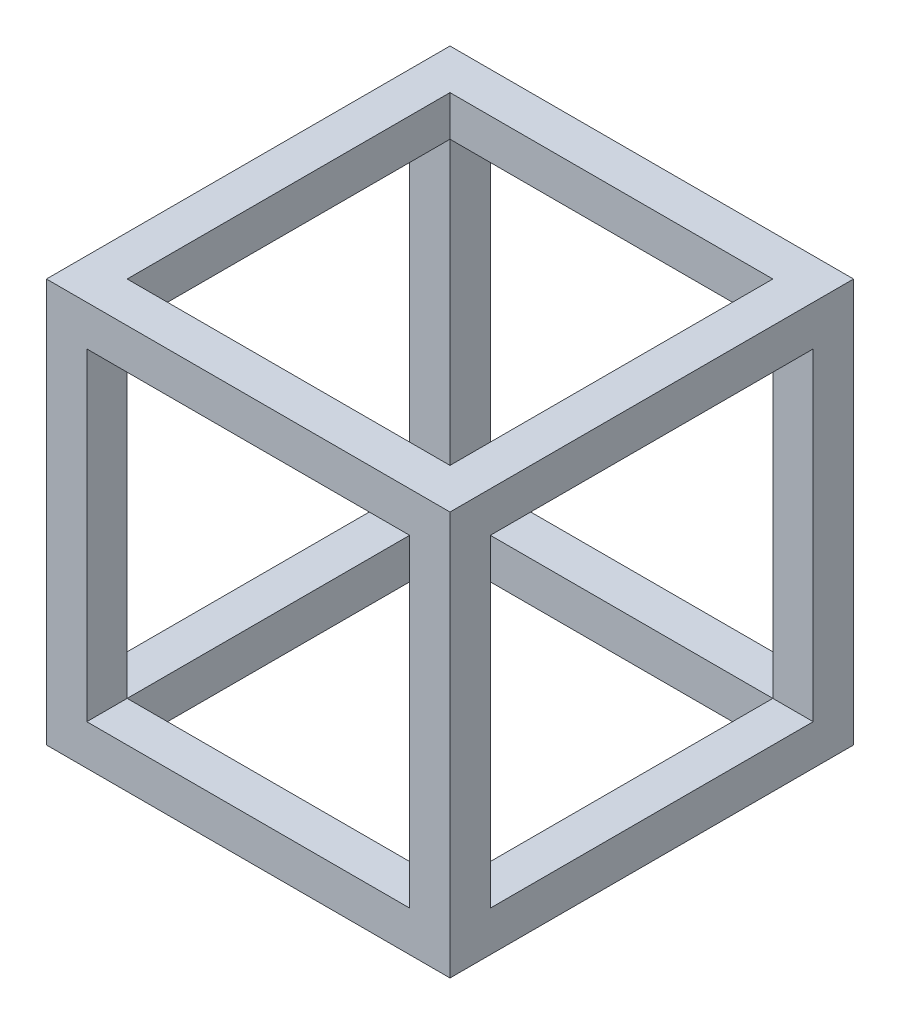
ISO-10303-21;
HEADER;
FILE_DESCRIPTION(('STEP AP214'),'2;1');
FILE_NAME('part.step','',(''),(''),'','','');
FILE_SCHEMA(('AUTOMOTIVE_DESIGN { 1 0 10303 214 1 1 1 1 }'));
ENDSEC;
DATA;
#1=APPLICATION_CONTEXT('core data for automotive mechanical design processes');
#2=APPLICATION_PROTOCOL_DEFINITION('international standard','automotive_design',2000,#1);
#3=PRODUCT_CONTEXT('',#1,'mechanical');
#4=PRODUCT('Part','Part','',(#3));
#5=PRODUCT_RELATED_PRODUCT_CATEGORY('part','',(#4));
#6=PRODUCT_DEFINITION_FORMATION('','',#4);
#7=PRODUCT_DEFINITION_CONTEXT('part definition',#1,'design');
#8=PRODUCT_DEFINITION('design','',#6,#7);
#9=PRODUCT_DEFINITION_SHAPE('','',#8);
#10=(LENGTH_UNIT() NAMED_UNIT(*) SI_UNIT(.MILLI.,.METRE.));
#11=(NAMED_UNIT(*) PLANE_ANGLE_UNIT() SI_UNIT($,.RADIAN.));
#12=(NAMED_UNIT(*) SI_UNIT($,.STERADIAN.) SOLID_ANGLE_UNIT());
#13=UNCERTAINTY_MEASURE_WITH_UNIT(LENGTH_MEASURE(1.E-05),#10,'distance_accuracy_value','');
#14=(GEOMETRIC_REPRESENTATION_CONTEXT(3) GLOBAL_UNCERTAINTY_ASSIGNED_CONTEXT((#13)) GLOBAL_UNIT_ASSIGNED_CONTEXT((#10,
#11,#12)) REPRESENTATION_CONTEXT('',''));
#15=CARTESIAN_POINT('',(0.,0.,0.));
#16=DIRECTION('',(0.,0.,1.));
#17=DIRECTION('',(1.,0.,0.));
#18=AXIS2_PLACEMENT_3D('',#15,#16,#17);
#19=CARTESIAN_POINT('',(10.,90.,0.));
#20=DIRECTION('',(0.,1.,0.));
#21=DIRECTION('',(0.,0.,1.));
#22=AXIS2_PLACEMENT_3D('',#19,#20,#21);
#23=PLANE('',#22);
#24=DIRECTION('',(1.,0.,0.));
#25=VECTOR('',#24,1.);
#26=CARTESIAN_POINT('',(0.,90.,10.));
#27=LINE('',#26,#25);
#28=CARTESIAN_POINT('',(0.,90.,10.));
#29=VERTEX_POINT('',#28);
#30=CARTESIAN_POINT('',(10.,90.,10.));
#31=VERTEX_POINT('',#30);
#32=EDGE_CURVE('E276',#29,#31,#27,.T.);
#33=ORIENTED_EDGE('',*,*,#32,.T.);
#34=DIRECTION('',(0.,0.,1.));
#35=VECTOR('',#34,1.);
#36=CARTESIAN_POINT('',(10.,90.,0.));
#37=LINE('',#36,#35);
#38=CARTESIAN_POINT('',(10.,90.,90.));
#39=VERTEX_POINT('',#38);
#40=EDGE_CURVE('E224',#31,#39,#37,.T.);
#41=ORIENTED_EDGE('',*,*,#40,.T.);
#42=DIRECTION('',(1.,0.,0.));
#43=VECTOR('',#42,1.);
#44=CARTESIAN_POINT('',(0.,90.,90.));
#45=LINE('',#44,#43);
#46=CARTESIAN_POINT('',(0.,90.,90.));
#47=VERTEX_POINT('',#46);
#48=EDGE_CURVE('E272',#47,#39,#45,.T.);
#49=ORIENTED_EDGE('',*,*,#48,.F.);
#50=DIRECTION('',(0.,0.,1.));
#51=VECTOR('',#50,1.);
#52=CARTESIAN_POINT('',(0.,90.,90.));
#53=LINE('',#52,#51);
#54=EDGE_CURVE('E243',#29,#47,#53,.T.);
#55=ORIENTED_EDGE('',*,*,#54,.F.);
#56=EDGE_LOOP('',(#33,#41,#49,#55));
#57=FACE_BOUND('',#56,.T.);
#58=ADVANCED_FACE('F38',(#57),#23,.F.);
#59=DIRECTION('',(0.,0.,1.));
#60=VECTOR('',#59,1.);
#61=CARTESIAN_POINT('',(90.,90.,0.));
#62=LINE('',#61,#60);
#63=CARTESIAN_POINT('',(90.,90.,0.));
#64=VERTEX_POINT('',#63);
#65=CARTESIAN_POINT('',(90.,90.,10.));
#66=VERTEX_POINT('',#65);
#67=EDGE_CURVE('E320',#64,#66,#62,.T.);
#68=ORIENTED_EDGE('',*,*,#67,.T.);
#69=DIRECTION('',(-1.,0.,0.));
#70=VECTOR('',#69,1.);
#71=CARTESIAN_POINT('',(10.,90.,10.));
#72=LINE('',#71,#70);
#73=EDGE_CURVE('E236',#66,#31,#72,.T.);
#74=ORIENTED_EDGE('',*,*,#73,.T.);
#75=DIRECTION('',(0.,0.,1.));
#76=VECTOR('',#75,1.);
#77=CARTESIAN_POINT('',(10.,90.,0.));
#78=LINE('',#77,#76);
#79=CARTESIAN_POINT('',(10.,90.,0.));
#80=VERTEX_POINT('',#79);
#81=EDGE_CURVE('E315',#80,#31,#78,.T.);
#82=ORIENTED_EDGE('',*,*,#81,.F.);
#83=DIRECTION('',(-1.,0.,0.));
#84=VECTOR('',#83,1.);
#85=CARTESIAN_POINT('',(10.,90.,0.));
#86=LINE('',#85,#84);
#87=EDGE_CURVE('E301',#64,#80,#86,.T.);
#88=ORIENTED_EDGE('',*,*,#87,.F.);
#89=EDGE_LOOP('',(#68,#74,#82,#88));
#90=FACE_BOUND('',#89,.T.);
#91=ADVANCED_FACE('F410',(#90),#23,.F.);
#92=CARTESIAN_POINT('',(90.,90.,90.));
#93=VERTEX_POINT('',#92);
#94=CARTESIAN_POINT('',(100.,90.,90.));
#95=VERTEX_POINT('',#94);
#96=EDGE_CURVE('E275',#93,#95,#45,.T.);
#97=ORIENTED_EDGE('',*,*,#96,.F.);
#98=DIRECTION('',(0.,0.,-1.));
#99=VECTOR('',#98,1.);
#100=CARTESIAN_POINT('',(90.,90.,0.));
#101=LINE('',#100,#99);
#102=EDGE_CURVE('E230',#93,#66,#101,.T.);
#103=ORIENTED_EDGE('',*,*,#102,.T.);
#104=CARTESIAN_POINT('',(100.,90.,10.));
#105=VERTEX_POINT('',#104);
#106=EDGE_CURVE('E253',#66,#105,#27,.T.);
#107=ORIENTED_EDGE('',*,*,#106,.T.);
#108=DIRECTION('',(0.,0.,1.));
#109=VECTOR('',#108,1.);
#110=CARTESIAN_POINT('',(100.,90.,90.));
#111=LINE('',#110,#109);
#112=EDGE_CURVE('E255',#105,#95,#111,.T.);
#113=ORIENTED_EDGE('',*,*,#112,.T.);
#114=EDGE_LOOP('',(#97,#103,#107,#113));
#115=FACE_BOUND('',#114,.T.);
#116=ADVANCED_FACE('F442',(#115),#23,.F.);
#117=CARTESIAN_POINT('',(10.,10.,0.));
#118=DIRECTION('',(0.,-1.,0.));
#119=DIRECTION('',(0.,0.,-1.));
#120=AXIS2_PLACEMENT_3D('',#117,#118,#119);
#121=PLANE('',#120);
#122=DIRECTION('',(1.,0.,0.));
#123=VECTOR('',#122,1.);
#124=CARTESIAN_POINT('',(0.,10.,90.));
#125=LINE('',#124,#123);
#126=CARTESIAN_POINT('',(0.,10.,90.));
#127=VERTEX_POINT('',#126);
#128=CARTESIAN_POINT('',(10.,10.,90.));
#129=VERTEX_POINT('',#128);
#130=EDGE_CURVE('E268',#127,#129,#125,.T.);
#131=ORIENTED_EDGE('',*,*,#130,.T.);
#132=DIRECTION('',(0.,0.,-1.));
#133=VECTOR('',#132,1.);
#134=CARTESIAN_POINT('',(10.,10.,0.));
#135=LINE('',#134,#133);
#136=CARTESIAN_POINT('',(10.,10.,10.));
#137=VERTEX_POINT('',#136);
#138=EDGE_CURVE('E185',#129,#137,#135,.T.);
#139=ORIENTED_EDGE('',*,*,#138,.T.);
#140=DIRECTION('',(1.,0.,0.));
#141=VECTOR('',#140,1.);
#142=CARTESIAN_POINT('',(0.,10.,10.));
#143=LINE('',#142,#141);
#144=CARTESIAN_POINT('',(0.,10.,10.));
#145=VERTEX_POINT('',#144);
#146=EDGE_CURVE('E263',#145,#137,#143,.T.);
#147=ORIENTED_EDGE('',*,*,#146,.F.);
#148=DIRECTION('',(0.,0.,-1.));
#149=VECTOR('',#148,1.);
#150=CARTESIAN_POINT('',(0.,10.,90.));
#151=LINE('',#150,#149);
#152=EDGE_CURVE('E250',#127,#145,#151,.T.);
#153=ORIENTED_EDGE('',*,*,#152,.F.);
#154=EDGE_LOOP('',(#131,#139,#147,#153));
#155=FACE_BOUND('',#154,.T.);
#156=ADVANCED_FACE('F371',(#155),#121,.F.);
#157=DIRECTION('',(0.,0.,1.));
#158=VECTOR('',#157,1.);
#159=CARTESIAN_POINT('',(10.,10.,0.));
#160=LINE('',#159,#158);
#161=CARTESIAN_POINT('',(10.,10.,0.));
#162=VERTEX_POINT('',#161);
#163=EDGE_CURVE('E328',#162,#137,#160,.T.);
#164=ORIENTED_EDGE('',*,*,#163,.T.);
#165=DIRECTION('',(1.,0.,0.));
#166=VECTOR('',#165,1.);
#167=CARTESIAN_POINT('',(10.,10.,10.));
#168=LINE('',#167,#166);
#169=CARTESIAN_POINT('',(90.,10.,10.));
#170=VERTEX_POINT('',#169);
#171=EDGE_CURVE('E11',#137,#170,#168,.T.);
#172=ORIENTED_EDGE('',*,*,#171,.T.);
#173=DIRECTION('',(0.,0.,1.));
#174=VECTOR('',#173,1.);
#175=CARTESIAN_POINT('',(90.,10.,0.));
#176=LINE('',#175,#174);
#177=CARTESIAN_POINT('',(90.,10.,0.));
#178=VERTEX_POINT('',#177);
#179=EDGE_CURVE('E324',#178,#170,#176,.T.);
#180=ORIENTED_EDGE('',*,*,#179,.F.);
#181=DIRECTION('',(1.,0.,0.));
#182=VECTOR('',#181,1.);
#183=CARTESIAN_POINT('',(10.,10.,0.));
#184=LINE('',#183,#182);
#185=EDGE_CURVE('E294',#162,#178,#184,.T.);
#186=ORIENTED_EDGE('',*,*,#185,.F.);
#187=EDGE_LOOP('',(#164,#172,#180,#186));
#188=FACE_BOUND('',#187,.T.);
#189=ADVANCED_FACE('F400',(#188),#121,.F.);
#190=CARTESIAN_POINT('',(100.,10.,10.));
#191=VERTEX_POINT('',#190);
#192=EDGE_CURVE('E267',#170,#191,#143,.T.);
#193=ORIENTED_EDGE('',*,*,#192,.F.);
#194=DIRECTION('',(0.,0.,1.));
#195=VECTOR('',#194,1.);
#196=CARTESIAN_POINT('',(90.,10.,0.));
#197=LINE('',#196,#195);
#198=CARTESIAN_POINT('',(90.,10.,90.));
#199=VERTEX_POINT('',#198);
#200=EDGE_CURVE('E227',#170,#199,#197,.T.);
#201=ORIENTED_EDGE('',*,*,#200,.T.);
#202=CARTESIAN_POINT('',(100.,10.,90.));
#203=VERTEX_POINT('',#202);
#204=EDGE_CURVE('E271',#199,#203,#125,.T.);
#205=ORIENTED_EDGE('',*,*,#204,.T.);
#206=DIRECTION('',(0.,0.,-1.));
#207=VECTOR('',#206,1.);
#208=CARTESIAN_POINT('',(100.,10.,90.));
#209=LINE('',#208,#207);
#210=EDGE_CURVE('E244',#203,#191,#209,.T.);
#211=ORIENTED_EDGE('',*,*,#210,.T.);
#212=EDGE_LOOP('',(#193,#201,#205,#211));
#213=FACE_BOUND('',#212,.T.);
#214=ADVANCED_FACE('F392',(#213),#121,.F.);
#215=CARTESIAN_POINT('',(10.,10.,0.));
#216=DIRECTION('',(-1.,0.,0.));
#217=DIRECTION('',(0.,0.,1.));
#218=AXIS2_PLACEMENT_3D('',#215,#216,#217);
#219=PLANE('',#218);
#220=ORIENTED_EDGE('',*,*,#81,.T.);
#221=DIRECTION('',(0.,-1.,0.));
#222=VECTOR('',#221,1.);
#223=CARTESIAN_POINT('',(10.,10.,10.));
#224=LINE('',#223,#222);
#225=EDGE_CURVE('E287',#31,#137,#224,.T.);
#226=ORIENTED_EDGE('',*,*,#225,.T.);
#227=ORIENTED_EDGE('',*,*,#163,.F.);
#228=DIRECTION('',(0.,-1.,0.));
#229=VECTOR('',#228,1.);
#230=CARTESIAN_POINT('',(10.,10.,0.));
#231=LINE('',#230,#229);
#232=EDGE_CURVE('E291',#80,#162,#231,.T.);
#233=ORIENTED_EDGE('',*,*,#232,.F.);
#234=EDGE_LOOP('',(#220,#226,#227,#233));
#235=FACE_BOUND('',#234,.T.);
#236=ADVANCED_FACE('F416',(#235),#219,.F.);
#237=CARTESIAN_POINT('',(90.,10.,0.));
#238=DIRECTION('',(1.,0.,0.));
#239=DIRECTION('',(0.,0.,-1.));
#240=AXIS2_PLACEMENT_3D('',#237,#238,#239);
#241=PLANE('',#240);
#242=ORIENTED_EDGE('',*,*,#179,.T.);
#243=DIRECTION('',(0.,1.,0.));
#244=VECTOR('',#243,1.);
#245=CARTESIAN_POINT('',(90.,10.,10.));
#246=LINE('',#245,#244);
#247=EDGE_CURVE('E284',#170,#66,#246,.T.);
#248=ORIENTED_EDGE('',*,*,#247,.T.);
#249=ORIENTED_EDGE('',*,*,#67,.F.);
#250=DIRECTION('',(0.,1.,0.));
#251=VECTOR('',#250,1.);
#252=CARTESIAN_POINT('',(90.,10.,0.));
#253=LINE('',#252,#251);
#254=EDGE_CURVE('E298',#178,#64,#253,.T.);
#255=ORIENTED_EDGE('',*,*,#254,.F.);
#256=EDGE_LOOP('',(#242,#248,#249,#255));
#257=FACE_BOUND('',#256,.T.);
#258=ADVANCED_FACE('F407',(#257),#241,.F.);
#259=CARTESIAN_POINT('',(0.,0.,100.));
#260=DIRECTION('',(1.,0.,0.));
#261=DIRECTION('',(0.,0.,-1.));
#262=AXIS2_PLACEMENT_3D('',#259,#260,#261);
#263=PLANE('',#262);
#264=ORIENTED_EDGE('',*,*,#152,.T.);
#265=DIRECTION('',(0.,1.,0.));
#266=VECTOR('',#265,1.);
#267=CARTESIAN_POINT('',(0.,10.,10.));
#268=LINE('',#267,#266);
#269=EDGE_CURVE('E240',#145,#29,#268,.T.);
#270=ORIENTED_EDGE('',*,*,#269,.T.);
#271=ORIENTED_EDGE('',*,*,#54,.T.);
#272=DIRECTION('',(0.,-1.,0.));
#273=VECTOR('',#272,1.);
#274=CARTESIAN_POINT('',(0.,10.,90.));
#275=LINE('',#274,#273);
#276=EDGE_CURVE('E247',#47,#127,#275,.T.);
#277=ORIENTED_EDGE('',*,*,#276,.T.);
#278=EDGE_LOOP('',(#264,#270,#271,#277));
#279=FACE_BOUND('',#278,.T.);
#280=DIRECTION('',(0.,-1.,0.));
#281=VECTOR('',#280,1.);
#282=CARTESIAN_POINT('',(0.,0.,0.));
#283=LINE('',#282,#281);
#284=CARTESIAN_POINT('',(0.,100.,0.));
#285=VERTEX_POINT('',#284);
#286=CARTESIAN_POINT('',(0.,0.,0.));
#287=VERTEX_POINT('',#286);
#288=EDGE_CURVE('E318',#285,#287,#283,.T.);
#289=ORIENTED_EDGE('',*,*,#288,.T.);
#290=DIRECTION('',(0.,0.,-1.));
#291=VECTOR('',#290,1.);
#292=CARTESIAN_POINT('',(0.,0.,100.));
#293=LINE('',#292,#291);
#294=CARTESIAN_POINT('',(0.,0.,100.));
#295=VERTEX_POINT('',#294);
#296=EDGE_CURVE('E357',#295,#287,#293,.T.);
#297=ORIENTED_EDGE('',*,*,#296,.F.);
#298=DIRECTION('',(0.,-1.,0.));
#299=VECTOR('',#298,1.);
#300=CARTESIAN_POINT('',(0.,0.,100.));
#301=LINE('',#300,#299);
#302=CARTESIAN_POINT('',(0.,100.,100.));
#303=VERTEX_POINT('',#302);
#304=EDGE_CURVE('E331',#303,#295,#301,.T.);
#305=ORIENTED_EDGE('',*,*,#304,.F.);
#306=DIRECTION('',(0.,0.,-1.));
#307=VECTOR('',#306,1.);
#308=CARTESIAN_POINT('',(0.,100.,100.));
#309=LINE('',#308,#307);
#310=EDGE_CURVE('E341',#303,#285,#309,.T.);
#311=ORIENTED_EDGE('',*,*,#310,.T.);
#312=EDGE_LOOP('',(#289,#297,#305,#311));
#313=FACE_BOUND('',#312,.T.);
#314=ADVANCED_FACE('F40',(#279,#313),#263,.F.);
#315=CARTESIAN_POINT('',(0.,0.,100.));
#316=DIRECTION('',(0.,1.,0.));
#317=DIRECTION('',(0.,0.,1.));
#318=AXIS2_PLACEMENT_3D('',#315,#316,#317);
#319=PLANE('',#318);
#320=DIRECTION('',(-1.,0.,0.));
#321=VECTOR('',#320,1.);
#322=CARTESIAN_POINT('',(90.,0.,10.));
#323=LINE('',#322,#321);
#324=CARTESIAN_POINT('',(90.,0.,10.));
#325=VERTEX_POINT('',#324);
#326=CARTESIAN_POINT('',(10.,0.,10.));
#327=VERTEX_POINT('',#326);
#328=EDGE_CURVE('E200',#325,#327,#323,.T.);
#329=ORIENTED_EDGE('',*,*,#328,.T.);
#330=DIRECTION('',(0.,0.,1.));
#331=VECTOR('',#330,1.);
#332=CARTESIAN_POINT('',(10.,0.,10.));
#333=LINE('',#332,#331);
#334=CARTESIAN_POINT('',(10.,0.,90.));
#335=VERTEX_POINT('',#334);
#336=EDGE_CURVE('E182',#327,#335,#333,.T.);
#337=ORIENTED_EDGE('',*,*,#336,.T.);
#338=DIRECTION('',(1.,0.,0.));
#339=VECTOR('',#338,1.);
#340=CARTESIAN_POINT('',(10.,0.,90.));
#341=LINE('',#340,#339);
#342=CARTESIAN_POINT('',(90.,0.,90.));
#343=VERTEX_POINT('',#342);
#344=EDGE_CURVE('E192',#335,#343,#341,.T.);
#345=ORIENTED_EDGE('',*,*,#344,.T.);
#346=DIRECTION('',(0.,0.,-1.));
#347=VECTOR('',#346,1.);
#348=CARTESIAN_POINT('',(90.,0.,90.));
#349=LINE('',#348,#347);
#350=EDGE_CURVE('E53',#343,#325,#349,.T.);
#351=ORIENTED_EDGE('',*,*,#350,.T.);
#352=EDGE_LOOP('',(#329,#337,#345,#351));
#353=FACE_BOUND('',#352,.T.);
#354=DIRECTION('',(1.,0.,0.));
#355=VECTOR('',#354,1.);
#356=CARTESIAN_POINT('',(0.,0.,0.));
#357=LINE('',#356,#355);
#358=CARTESIAN_POINT('',(100.,0.,0.));
#359=VERTEX_POINT('',#358);
#360=EDGE_CURVE('E344',#287,#359,#357,.T.);
#361=ORIENTED_EDGE('',*,*,#360,.T.);
#362=DIRECTION('',(0.,0.,-1.));
#363=VECTOR('',#362,1.);
#364=CARTESIAN_POINT('',(100.,0.,100.));
#365=LINE('',#364,#363);
#366=CARTESIAN_POINT('',(100.,0.,100.));
#367=VERTEX_POINT('',#366);
#368=EDGE_CURVE('E354',#367,#359,#365,.T.);
#369=ORIENTED_EDGE('',*,*,#368,.F.);
#370=DIRECTION('',(1.,0.,0.));
#371=VECTOR('',#370,1.);
#372=CARTESIAN_POINT('',(0.,0.,100.));
#373=LINE('',#372,#371);
#374=EDGE_CURVE('E334',#295,#367,#373,.T.);
#375=ORIENTED_EDGE('',*,*,#374,.F.);
#376=ORIENTED_EDGE('',*,*,#296,.T.);
#377=EDGE_LOOP('',(#361,#369,#375,#376));
#378=FACE_BOUND('',#377,.T.);
#379=ADVANCED_FACE('F197',(#353,#378),#319,.F.);
#380=CARTESIAN_POINT('',(100.,0.,100.));
#381=DIRECTION('',(-1.,0.,0.));
#382=DIRECTION('',(0.,0.,1.));
#383=AXIS2_PLACEMENT_3D('',#380,#381,#382);
#384=PLANE('',#383);
#385=ORIENTED_EDGE('',*,*,#112,.F.);
#386=DIRECTION('',(0.,1.,0.));
#387=VECTOR('',#386,1.);
#388=CARTESIAN_POINT('',(100.,10.,10.));
#389=LINE('',#388,#387);
#390=EDGE_CURVE('E239',#191,#105,#389,.T.);
#391=ORIENTED_EDGE('',*,*,#390,.F.);
#392=ORIENTED_EDGE('',*,*,#210,.F.);
#393=DIRECTION('',(0.,-1.,0.));
#394=VECTOR('',#393,1.);
#395=CARTESIAN_POINT('',(100.,10.,90.));
#396=LINE('',#395,#394);
#397=EDGE_CURVE('E258',#95,#203,#396,.T.);
#398=ORIENTED_EDGE('',*,*,#397,.F.);
#399=EDGE_LOOP('',(#385,#391,#392,#398));
#400=FACE_BOUND('',#399,.T.);
#401=DIRECTION('',(0.,1.,0.));
#402=VECTOR('',#401,1.);
#403=CARTESIAN_POINT('',(100.,0.,0.));
#404=LINE('',#403,#402);
#405=CARTESIAN_POINT('',(100.,100.,0.));
#406=VERTEX_POINT('',#405);
#407=EDGE_CURVE('E346',#359,#406,#404,.T.);
#408=ORIENTED_EDGE('',*,*,#407,.T.);
#409=DIRECTION('',(0.,0.,-1.));
#410=VECTOR('',#409,1.);
#411=CARTESIAN_POINT('',(100.,100.,100.));
#412=LINE('',#411,#410);
#413=CARTESIAN_POINT('',(100.,100.,100.));
#414=VERTEX_POINT('',#413);
#415=EDGE_CURVE('E351',#414,#406,#412,.T.);
#416=ORIENTED_EDGE('',*,*,#415,.F.);
#417=DIRECTION('',(0.,1.,0.));
#418=VECTOR('',#417,1.);
#419=CARTESIAN_POINT('',(100.,0.,100.));
#420=LINE('',#419,#418);
#421=EDGE_CURVE('E337',#367,#414,#420,.T.);
#422=ORIENTED_EDGE('',*,*,#421,.F.);
#423=ORIENTED_EDGE('',*,*,#368,.T.);
#424=EDGE_LOOP('',(#408,#416,#422,#423));
#425=FACE_BOUND('',#424,.T.);
#426=ADVANCED_FACE('F445',(#400,#425),#384,.F.);
#427=CARTESIAN_POINT('',(0.,100.,100.));
#428=DIRECTION('',(0.,-1.,0.));
#429=DIRECTION('',(0.,0.,-1.));
#430=AXIS2_PLACEMENT_3D('',#427,#428,#429);
#431=PLANE('',#430);
#432=DIRECTION('',(1.,0.,0.));
#433=VECTOR('',#432,1.);
#434=CARTESIAN_POINT('',(10.,100.,90.));
#435=LINE('',#434,#433);
#436=CARTESIAN_POINT('',(10.,100.,90.));
#437=VERTEX_POINT('',#436);
#438=CARTESIAN_POINT('',(90.,100.,90.));
#439=VERTEX_POINT('',#438);
#440=EDGE_CURVE('E210',#437,#439,#435,.T.);
#441=ORIENTED_EDGE('',*,*,#440,.F.);
#442=DIRECTION('',(0.,0.,1.));
#443=VECTOR('',#442,1.);
#444=CARTESIAN_POINT('',(10.,100.,10.));
#445=LINE('',#444,#443);
#446=CARTESIAN_POINT('',(10.,100.,10.));
#447=VERTEX_POINT('',#446);
#448=EDGE_CURVE('E61',#447,#437,#445,.T.);
#449=ORIENTED_EDGE('',*,*,#448,.F.);
#450=DIRECTION('',(-1.,0.,0.));
#451=VECTOR('',#450,1.);
#452=CARTESIAN_POINT('',(90.,100.,10.));
#453=LINE('',#452,#451);
#454=CARTESIAN_POINT('',(90.,100.,10.));
#455=VERTEX_POINT('',#454);
#456=EDGE_CURVE('E201',#455,#447,#453,.T.);
#457=ORIENTED_EDGE('',*,*,#456,.F.);
#458=DIRECTION('',(0.,0.,-1.));
#459=VECTOR('',#458,1.);
#460=CARTESIAN_POINT('',(90.,100.,90.));
#461=LINE('',#460,#459);
#462=EDGE_CURVE('E204',#439,#455,#461,.T.);
#463=ORIENTED_EDGE('',*,*,#462,.F.);
#464=EDGE_LOOP('',(#441,#449,#457,#463));
#465=FACE_BOUND('',#464,.T.);
#466=DIRECTION('',(-1.,0.,0.));
#467=VECTOR('',#466,1.);
#468=CARTESIAN_POINT('',(0.,100.,0.));
#469=LINE('',#468,#467);
#470=EDGE_CURVE('E335',#406,#285,#469,.T.);
#471=ORIENTED_EDGE('',*,*,#470,.T.);
#472=ORIENTED_EDGE('',*,*,#310,.F.);
#473=DIRECTION('',(-1.,0.,0.));
#474=VECTOR('',#473,1.);
#475=CARTESIAN_POINT('',(0.,100.,100.));
#476=LINE('',#475,#474);
#477=EDGE_CURVE('E339',#414,#303,#476,.T.);
#478=ORIENTED_EDGE('',*,*,#477,.F.);
#479=ORIENTED_EDGE('',*,*,#415,.T.);
#480=EDGE_LOOP('',(#471,#472,#478,#479));
#481=FACE_BOUND('',#480,.T.);
#482=ADVANCED_FACE('F434',(#465,#481),#431,.F.);
#483=CARTESIAN_POINT('',(0.,0.,100.));
#484=DIRECTION('',(0.,0.,-1.));
#485=DIRECTION('',(-1.,0.,0.));
#486=AXIS2_PLACEMENT_3D('',#483,#484,#485);
#487=PLANE('',#486);
#488=DIRECTION('',(1.,0.,0.));
#489=VECTOR('',#488,1.);
#490=CARTESIAN_POINT('',(10.,10.,100.));
#491=LINE('',#490,#489);
#492=CARTESIAN_POINT('',(10.,10.,100.));
#493=VERTEX_POINT('',#492);
#494=CARTESIAN_POINT('',(90.,10.,100.));
#495=VERTEX_POINT('',#494);
#496=EDGE_CURVE('E307',#493,#495,#491,.T.);
#497=ORIENTED_EDGE('',*,*,#496,.F.);
#498=DIRECTION('',(0.,-1.,0.));
#499=VECTOR('',#498,1.);
#500=CARTESIAN_POINT('',(10.,10.,100.));
#501=LINE('',#500,#499);
#502=CARTESIAN_POINT('',(10.,90.,100.));
#503=VERTEX_POINT('',#502);
#504=EDGE_CURVE('E290',#503,#493,#501,.T.);
#505=ORIENTED_EDGE('',*,*,#504,.F.);
#506=DIRECTION('',(-1.,0.,0.));
#507=VECTOR('',#506,1.);
#508=CARTESIAN_POINT('',(10.,90.,100.));
#509=LINE('',#508,#507);
#510=CARTESIAN_POINT('',(90.,90.,100.));
#511=VERTEX_POINT('',#510);
#512=EDGE_CURVE('E295',#511,#503,#509,.T.);
#513=ORIENTED_EDGE('',*,*,#512,.F.);
#514=DIRECTION('',(0.,1.,0.));
#515=VECTOR('',#514,1.);
#516=CARTESIAN_POINT('',(90.,10.,100.));
#517=LINE('',#516,#515);
#518=EDGE_CURVE('E310',#495,#511,#517,.T.);
#519=ORIENTED_EDGE('',*,*,#518,.F.);
#520=EDGE_LOOP('',(#497,#505,#513,#519));
#521=FACE_BOUND('',#520,.T.);
#522=ORIENTED_EDGE('',*,*,#304,.T.);
#523=ORIENTED_EDGE('',*,*,#374,.T.);
#524=ORIENTED_EDGE('',*,*,#421,.T.);
#525=ORIENTED_EDGE('',*,*,#477,.T.);
#526=EDGE_LOOP('',(#522,#523,#524,#525));
#527=FACE_BOUND('',#526,.T.);
#528=ADVANCED_FACE('F378',(#521,#527),#487,.F.);
#529=CARTESIAN_POINT('',(0.,0.,0.));
#530=DIRECTION('',(0.,0.,-1.));
#531=DIRECTION('',(-1.,0.,0.));
#532=AXIS2_PLACEMENT_3D('',#529,#530,#531);
#533=PLANE('',#532);
#534=ORIENTED_EDGE('',*,*,#232,.T.);
#535=ORIENTED_EDGE('',*,*,#185,.T.);
#536=ORIENTED_EDGE('',*,*,#254,.T.);
#537=ORIENTED_EDGE('',*,*,#87,.T.);
#538=EDGE_LOOP('',(#534,#535,#536,#537));
#539=FACE_BOUND('',#538,.T.);
#540=ORIENTED_EDGE('',*,*,#288,.F.);
#541=ORIENTED_EDGE('',*,*,#470,.F.);
#542=ORIENTED_EDGE('',*,*,#407,.F.);
#543=ORIENTED_EDGE('',*,*,#360,.F.);
#544=EDGE_LOOP('',(#540,#541,#542,#543));
#545=FACE_BOUND('',#544,.T.);
#546=ADVANCED_FACE('F413',(#539,#545),#533,.T.);
#547=EDGE_CURVE('E304',#129,#493,#160,.T.);
#548=ORIENTED_EDGE('',*,*,#547,.F.);
#549=DIRECTION('',(0.,1.,0.));
#550=VECTOR('',#549,1.);
#551=CARTESIAN_POINT('',(10.,10.,90.));
#552=LINE('',#551,#550);
#553=EDGE_CURVE('E281',#129,#39,#552,.T.);
#554=ORIENTED_EDGE('',*,*,#553,.T.);
#555=EDGE_CURVE('E319',#39,#503,#78,.T.);
#556=ORIENTED_EDGE('',*,*,#555,.T.);
#557=ORIENTED_EDGE('',*,*,#504,.T.);
#558=EDGE_LOOP('',(#548,#554,#556,#557));
#559=FACE_BOUND('',#558,.T.);
#560=ADVANCED_FACE('F372',(#559),#219,.F.);
#561=ORIENTED_EDGE('',*,*,#555,.F.);
#562=DIRECTION('',(1.,0.,0.));
#563=VECTOR('',#562,1.);
#564=CARTESIAN_POINT('',(10.,90.,90.));
#565=LINE('',#564,#563);
#566=EDGE_CURVE('E233',#39,#93,#565,.T.);
#567=ORIENTED_EDGE('',*,*,#566,.T.);
#568=EDGE_CURVE('E323',#93,#511,#62,.T.);
#569=ORIENTED_EDGE('',*,*,#568,.T.);
#570=ORIENTED_EDGE('',*,*,#512,.T.);
#571=EDGE_LOOP('',(#561,#567,#569,#570));
#572=FACE_BOUND('',#571,.T.);
#573=ADVANCED_FACE('F440',(#572),#23,.F.);
#574=ORIENTED_EDGE('',*,*,#568,.F.);
#575=DIRECTION('',(0.,-1.,0.));
#576=VECTOR('',#575,1.);
#577=CARTESIAN_POINT('',(90.,10.,90.));
#578=LINE('',#577,#576);
#579=EDGE_CURVE('E266',#93,#199,#578,.T.);
#580=ORIENTED_EDGE('',*,*,#579,.T.);
#581=EDGE_CURVE('E327',#199,#495,#176,.T.);
#582=ORIENTED_EDGE('',*,*,#581,.T.);
#583=ORIENTED_EDGE('',*,*,#518,.T.);
#584=EDGE_LOOP('',(#574,#580,#582,#583));
#585=FACE_BOUND('',#584,.T.);
#586=ADVANCED_FACE('F382',(#585),#241,.F.);
#587=ORIENTED_EDGE('',*,*,#581,.F.);
#588=DIRECTION('',(-1.,0.,0.));
#589=VECTOR('',#588,1.);
#590=CARTESIAN_POINT('',(10.,10.,90.));
#591=LINE('',#590,#589);
#592=EDGE_CURVE('E46',#199,#129,#591,.T.);
#593=ORIENTED_EDGE('',*,*,#592,.T.);
#594=ORIENTED_EDGE('',*,*,#547,.T.);
#595=ORIENTED_EDGE('',*,*,#496,.T.);
#596=EDGE_LOOP('',(#587,#593,#594,#595));
#597=FACE_BOUND('',#596,.T.);
#598=ADVANCED_FACE('F362',(#597),#121,.F.);
#599=CARTESIAN_POINT('',(0.,10.,90.));
#600=DIRECTION('',(0.,0.,1.));
#601=DIRECTION('',(1.,0.,0.));
#602=AXIS2_PLACEMENT_3D('',#599,#600,#601);
#603=PLANE('',#602);
#604=ORIENTED_EDGE('',*,*,#96,.T.);
#605=ORIENTED_EDGE('',*,*,#397,.T.);
#606=ORIENTED_EDGE('',*,*,#204,.F.);
#607=ORIENTED_EDGE('',*,*,#579,.F.);
#608=EDGE_LOOP('',(#604,#605,#606,#607));
#609=FACE_BOUND('',#608,.T.);
#610=ADVANCED_FACE('F386',(#609),#603,.F.);
#611=CARTESIAN_POINT('',(0.,10.,10.));
#612=DIRECTION('',(0.,0.,-1.));
#613=DIRECTION('',(-1.,0.,0.));
#614=AXIS2_PLACEMENT_3D('',#611,#612,#613);
#615=PLANE('',#614);
#616=ORIENTED_EDGE('',*,*,#192,.T.);
#617=ORIENTED_EDGE('',*,*,#390,.T.);
#618=ORIENTED_EDGE('',*,*,#106,.F.);
#619=ORIENTED_EDGE('',*,*,#247,.F.);
#620=EDGE_LOOP('',(#616,#617,#618,#619));
#621=FACE_BOUND('',#620,.T.);
#622=ADVANCED_FACE('F404',(#621),#615,.F.);
#623=ORIENTED_EDGE('',*,*,#32,.F.);
#624=ORIENTED_EDGE('',*,*,#269,.F.);
#625=ORIENTED_EDGE('',*,*,#146,.T.);
#626=ORIENTED_EDGE('',*,*,#225,.F.);
#627=EDGE_LOOP('',(#623,#624,#625,#626));
#628=FACE_BOUND('',#627,.T.);
#629=ADVANCED_FACE('F419',(#628),#615,.F.);
#630=ORIENTED_EDGE('',*,*,#130,.F.);
#631=ORIENTED_EDGE('',*,*,#276,.F.);
#632=ORIENTED_EDGE('',*,*,#48,.T.);
#633=ORIENTED_EDGE('',*,*,#553,.F.);
#634=EDGE_LOOP('',(#630,#631,#632,#633));
#635=FACE_BOUND('',#634,.T.);
#636=ADVANCED_FACE('F365',(#635),#603,.F.);
#637=CARTESIAN_POINT('',(10.,0.,90.));
#638=DIRECTION('',(0.,0.,1.));
#639=DIRECTION('',(1.,0.,0.));
#640=AXIS2_PLACEMENT_3D('',#637,#638,#639);
#641=PLANE('',#640);
#642=DIRECTION('',(0.,1.,0.));
#643=VECTOR('',#642,1.);
#644=CARTESIAN_POINT('',(90.,0.,90.));
#645=LINE('',#644,#643);
#646=EDGE_CURVE('E194',#343,#199,#645,.T.);
#647=ORIENTED_EDGE('',*,*,#646,.F.);
#648=ORIENTED_EDGE('',*,*,#344,.F.);
#649=DIRECTION('',(0.,1.,0.));
#650=VECTOR('',#649,1.);
#651=CARTESIAN_POINT('',(10.,0.,90.));
#652=LINE('',#651,#650);
#653=EDGE_CURVE('E177',#335,#129,#652,.T.);
#654=ORIENTED_EDGE('',*,*,#653,.T.);
#655=ORIENTED_EDGE('',*,*,#592,.F.);
#656=EDGE_LOOP('',(#647,#648,#654,#655));
#657=FACE_BOUND('',#656,.T.);
#658=ADVANCED_FACE('F193',(#657),#641,.F.);
#659=CARTESIAN_POINT('',(90.,0.,90.));
#660=DIRECTION('',(1.,0.,0.));
#661=DIRECTION('',(0.,0.,-1.));
#662=AXIS2_PLACEMENT_3D('',#659,#660,#661);
#663=PLANE('',#662);
#664=DIRECTION('',(0.,1.,0.));
#665=VECTOR('',#664,1.);
#666=CARTESIAN_POINT('',(90.,0.,10.));
#667=LINE('',#666,#665);
#668=EDGE_CURVE('E218',#325,#170,#667,.T.);
#669=ORIENTED_EDGE('',*,*,#668,.F.);
#670=ORIENTED_EDGE('',*,*,#350,.F.);
#671=ORIENTED_EDGE('',*,*,#646,.T.);
#672=ORIENTED_EDGE('',*,*,#200,.F.);
#673=EDGE_LOOP('',(#669,#670,#671,#672));
#674=FACE_BOUND('',#673,.T.);
#675=ADVANCED_FACE('F394',(#674),#663,.F.);
#676=CARTESIAN_POINT('',(90.,0.,10.));
#677=DIRECTION('',(0.,0.,-1.));
#678=DIRECTION('',(-1.,0.,0.));
#679=AXIS2_PLACEMENT_3D('',#676,#677,#678);
#680=PLANE('',#679);
#681=DIRECTION('',(0.,1.,0.));
#682=VECTOR('',#681,1.);
#683=CARTESIAN_POINT('',(10.,0.,10.));
#684=LINE('',#683,#682);
#685=EDGE_CURVE('E215',#327,#137,#684,.T.);
#686=ORIENTED_EDGE('',*,*,#685,.F.);
#687=ORIENTED_EDGE('',*,*,#328,.F.);
#688=ORIENTED_EDGE('',*,*,#668,.T.);
#689=ORIENTED_EDGE('',*,*,#171,.F.);
#690=EDGE_LOOP('',(#686,#687,#688,#689));
#691=FACE_BOUND('',#690,.T.);
#692=ADVANCED_FACE('F396',(#691),#680,.F.);
#693=CARTESIAN_POINT('',(10.,0.,10.));
#694=DIRECTION('',(-1.,0.,0.));
#695=DIRECTION('',(0.,0.,1.));
#696=AXIS2_PLACEMENT_3D('',#693,#694,#695);
#697=PLANE('',#696);
#698=ORIENTED_EDGE('',*,*,#653,.F.);
#699=ORIENTED_EDGE('',*,*,#336,.F.);
#700=ORIENTED_EDGE('',*,*,#685,.T.);
#701=ORIENTED_EDGE('',*,*,#138,.F.);
#702=EDGE_LOOP('',(#698,#699,#700,#701));
#703=FACE_BOUND('',#702,.T.);
#704=ADVANCED_FACE('F179',(#703),#697,.F.);
#705=EDGE_CURVE('E221',#66,#455,#667,.T.);
#706=ORIENTED_EDGE('',*,*,#705,.T.);
#707=ORIENTED_EDGE('',*,*,#456,.T.);
#708=EDGE_CURVE('E217',#31,#447,#684,.T.);
#709=ORIENTED_EDGE('',*,*,#708,.F.);
#710=ORIENTED_EDGE('',*,*,#73,.F.);
#711=EDGE_LOOP('',(#706,#707,#709,#710));
#712=FACE_BOUND('',#711,.T.);
#713=ADVANCED_FACE('F428',(#712),#680,.F.);
#714=EDGE_CURVE('E189',#39,#437,#652,.T.);
#715=ORIENTED_EDGE('',*,*,#714,.T.);
#716=ORIENTED_EDGE('',*,*,#440,.T.);
#717=EDGE_CURVE('E188',#93,#439,#645,.T.);
#718=ORIENTED_EDGE('',*,*,#717,.F.);
#719=ORIENTED_EDGE('',*,*,#566,.F.);
#720=EDGE_LOOP('',(#715,#716,#718,#719));
#721=FACE_BOUND('',#720,.T.);
#722=ADVANCED_FACE('F437',(#721),#641,.F.);
#723=ORIENTED_EDGE('',*,*,#717,.T.);
#724=ORIENTED_EDGE('',*,*,#462,.T.);
#725=ORIENTED_EDGE('',*,*,#705,.F.);
#726=ORIENTED_EDGE('',*,*,#102,.F.);
#727=EDGE_LOOP('',(#723,#724,#725,#726));
#728=FACE_BOUND('',#727,.T.);
#729=ADVANCED_FACE('F583',(#728),#663,.F.);
#730=ORIENTED_EDGE('',*,*,#708,.T.);
#731=ORIENTED_EDGE('',*,*,#448,.T.);
#732=ORIENTED_EDGE('',*,*,#714,.F.);
#733=ORIENTED_EDGE('',*,*,#40,.F.);
#734=EDGE_LOOP('',(#730,#731,#732,#733));
#735=FACE_BOUND('',#734,.T.);
#736=ADVANCED_FACE('F426',(#735),#697,.F.);
#737=CLOSED_SHELL('',(#58,#91,#116,#156,#189,#214,#236,#258,#314,#379,#426,#482,#528,#546,#560,
#573,#586,#598,#610,#622,#629,#636,#658,#675,#692,#704,#713,#722,#729,#736));
#738=MANIFOLD_SOLID_BREP('B2',#737);
#739=ADVANCED_BREP_SHAPE_REPRESENTATION('',(#18,#738),#14);
#740=SHAPE_DEFINITION_REPRESENTATION(#9,#739);
ENDSEC;
END-ISO-10303-21;
